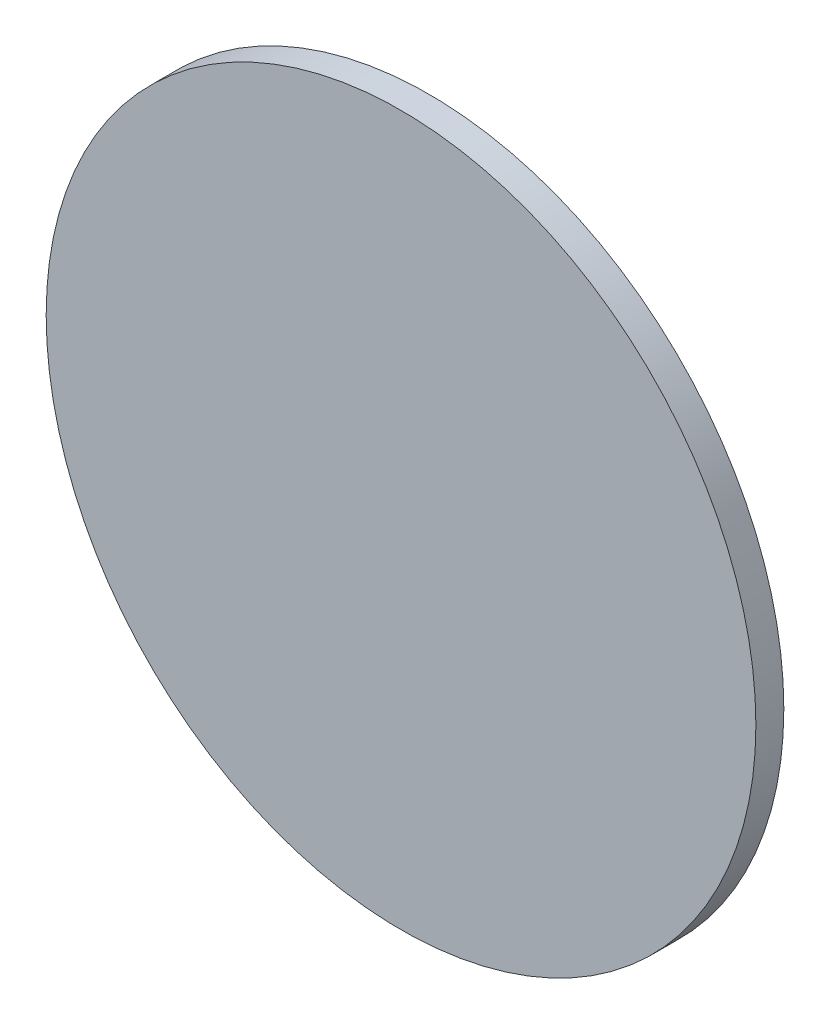
ISO-10303-21;
HEADER;
FILE_DESCRIPTION(('STEP AP214'),'2;1');
FILE_NAME('part.step','',(''),(''),'','','');
FILE_SCHEMA(('AUTOMOTIVE_DESIGN { 1 0 10303 214 1 1 1 1 }'));
ENDSEC;
DATA;
#1=APPLICATION_CONTEXT('core data for automotive mechanical design processes');
#2=APPLICATION_PROTOCOL_DEFINITION('international standard','automotive_design',2000,#1);
#3=PRODUCT_CONTEXT('',#1,'mechanical');
#4=PRODUCT('Part','Part','',(#3));
#5=PRODUCT_RELATED_PRODUCT_CATEGORY('part','',(#4));
#6=PRODUCT_DEFINITION_FORMATION('','',#4);
#7=PRODUCT_DEFINITION_CONTEXT('part definition',#1,'design');
#8=PRODUCT_DEFINITION('design','',#6,#7);
#9=PRODUCT_DEFINITION_SHAPE('','',#8);
#10=(LENGTH_UNIT() NAMED_UNIT(*) SI_UNIT(.MILLI.,.METRE.));
#11=(NAMED_UNIT(*) PLANE_ANGLE_UNIT() SI_UNIT($,.RADIAN.));
#12=(NAMED_UNIT(*) SI_UNIT($,.STERADIAN.) SOLID_ANGLE_UNIT());
#13=UNCERTAINTY_MEASURE_WITH_UNIT(LENGTH_MEASURE(1.E-05),#10,'distance_accuracy_value','');
#14=(GEOMETRIC_REPRESENTATION_CONTEXT(3) GLOBAL_UNCERTAINTY_ASSIGNED_CONTEXT((#13)) GLOBAL_UNIT_ASSIGNED_CONTEXT((#10,
#11,#12)) REPRESENTATION_CONTEXT('',''));
#15=CARTESIAN_POINT('',(0.,0.,0.));
#16=DIRECTION('',(0.,0.,1.));
#17=DIRECTION('',(1.,0.,0.));
#18=AXIS2_PLACEMENT_3D('',#15,#16,#17);
#19=CARTESIAN_POINT('',(0.,0.,3.));
#20=DIRECTION('',(0.,0.,-1.));
#21=DIRECTION('',(-1.,0.,0.));
#22=AXIS2_PLACEMENT_3D('',#19,#20,#21);
#23=CYLINDRICAL_SURFACE('',#22,38.1);
#24=CARTESIAN_POINT('',(0.,0.,3.));
#25=DIRECTION('',(0.,0.,1.));
#26=DIRECTION('',(1.,0.,0.));
#27=AXIS2_PLACEMENT_3D('',#24,#25,#26);
#28=CIRCLE('',#27,38.1);
#29=CARTESIAN_POINT('',(38.1,0.,3.));
#30=VERTEX_POINT('',#29);
#31=EDGE_CURVE('E61',#30,#30,#28,.T.);
#32=ORIENTED_EDGE('',*,*,#31,.F.);
#33=EDGE_LOOP('',(#32));
#34=FACE_BOUND('',#33,.T.);
#35=CARTESIAN_POINT('',(0.,0.,0.));
#36=DIRECTION('',(0.,0.,1.));
#37=DIRECTION('',(1.,0.,0.));
#38=AXIS2_PLACEMENT_3D('',#35,#36,#37);
#39=CIRCLE('',#38,38.1);
#40=CARTESIAN_POINT('',(38.1,0.,0.));
#41=VERTEX_POINT('',#40);
#42=EDGE_CURVE('E58',#41,#41,#39,.T.);
#43=ORIENTED_EDGE('',*,*,#42,.T.);
#44=EDGE_LOOP('',(#43));
#45=FACE_BOUND('',#44,.T.);
#46=ADVANCED_FACE('F35',(#34,#45),#23,.T.);
#47=CARTESIAN_POINT('',(0.,0.,3.));
#48=DIRECTION('',(0.,0.,1.));
#49=DIRECTION('',(1.,0.,0.));
#50=AXIS2_PLACEMENT_3D('',#47,#48,#49);
#51=PLANE('',#50);
#52=ORIENTED_EDGE('',*,*,#31,.T.);
#53=EDGE_LOOP('',(#52));
#54=FACE_BOUND('',#53,.T.);
#55=ADVANCED_FACE('F100',(#54),#51,.T.);
#56=CARTESIAN_POINT('',(0.,0.,0.));
#57=DIRECTION('',(0.,0.,1.));
#58=DIRECTION('',(1.,0.,0.));
#59=AXIS2_PLACEMENT_3D('',#56,#57,#58);
#60=PLANE('',#59);
#61=CARTESIAN_POINT('',(0.,0.,0.));
#62=DIRECTION('',(0.,0.,1.));
#63=DIRECTION('',(1.,0.,0.));
#64=AXIS2_PLACEMENT_3D('',#61,#62,#63);
#65=CIRCLE('',#64,1.75);
#66=CARTESIAN_POINT('',(1.75,0.,0.));
#67=VERTEX_POINT('',#66);
#68=EDGE_CURVE('E11',#67,#67,#65,.T.);
#69=ORIENTED_EDGE('',*,*,#68,.T.);
#70=EDGE_LOOP('',(#69));
#71=FACE_BOUND('',#70,.T.);
#72=ORIENTED_EDGE('',*,*,#42,.F.);
#73=EDGE_LOOP('',(#72));
#74=FACE_BOUND('',#73,.T.);
#75=ADVANCED_FACE('F98',(#71,#74),#60,.F.);
#76=CARTESIAN_POINT('',(2.,0.,-2.53589838486224));
#77=DIRECTION('',(-0.866025403784439,0.,0.5));
#78=DIRECTION('',(0.5,0.,0.866025403784439));
#79=AXIS2_PLACEMENT_3D('',#76,#77,#78);
#80=PLANE('',#79);
#81=CARTESIAN_POINT('',(2.,0.,-2.53589838486224));
#82=DIRECTION('',(-0.866025403784439,0.,0.5));
#83=DIRECTION('',(0.5,0.,0.866025403784439));
#84=AXIS2_PLACEMENT_3D('',#81,#82,#83);
#85=CIRCLE('',#84,0.75);
#86=CARTESIAN_POINT('',(2.375,0.,-1.88637933202392));
#87=VERTEX_POINT('',#86);
#88=EDGE_CURVE('E55',#87,#87,#85,.T.);
#89=ORIENTED_EDGE('',*,*,#88,.T.);
#90=EDGE_LOOP('',(#89));
#91=FACE_BOUND('',#90,.T.);
#92=ADVANCED_FACE('F89',(#91),#80,.T.);
#93=CARTESIAN_POINT('',(0.925,0.,-1.25));
#94=CARTESIAN_POINT('',(0.770833333333349,0.,-1.25));
#95=CARTESIAN_POINT('',(0.616666666666668,0.,-1.25));
#96=CARTESIAN_POINT('',(0.308333333333332,0.,-1.25));
#97=CARTESIAN_POINT('',(0.16861952633005,0.,-1.24998855800885));
#98=CARTESIAN_POINT('',(-0.263004260270211,0.,-1.25001784664257));
#99=CARTESIAN_POINT('',(-0.570565239422642,0.,-1.27578520813754));
#100=CARTESIAN_POINT('',(-1.13142949881977,0.,-1.37792066472334));
#101=CARTESIAN_POINT('',(-1.40723122850012,0.,-1.45429679643273));
#102=CARTESIAN_POINT('',(-2.20734245659167,0.,-1.75559089364515));
#103=CARTESIAN_POINT('',(-2.70337545902059,0.,-2.05296144874494));
#104=CARTESIAN_POINT('',(-3.98892694713479,0.,-3.18035984593469));
#105=CARTESIAN_POINT('',(-4.56057414059163,0.,-4.24983630097013));
#106=CARTESIAN_POINT('',(-4.85815204245957,0.,-6.51016487293938));
#107=CARTESIAN_POINT('',(-4.58278429455121,0.,-7.69115273551687));
#108=CARTESIAN_POINT('',(-3.31617702232297,0.,-9.58676447816934));
#109=CARTESIAN_POINT('',(-2.33046518287406,0.,-10.293115593208));
#110=CARTESIAN_POINT('',(-0.128315745599885,0.,-10.8831797565381));
#111=CARTESIAN_POINT('',(1.07851130569454,0.,-10.7643176666464));
#112=CARTESIAN_POINT('',(3.12323125138598,0.,-9.75597337791413));
#113=CARTESIAN_POINT('',(3.95220064774742,0.,-8.87089176131491));
#114=CARTESIAN_POINT('',(4.82465491110981,0.,-6.76460084615345));
#115=CARTESIAN_POINT('',(4.86433214709326,0.,-5.55258347062059));
#116=CARTESIAN_POINT('',(4.13150408311024,0.,-3.39374160899938));
#117=CARTESIAN_POINT('',(3.3641670674886,0.,-2.45747520661821));
#118=CARTESIAN_POINT('',(2.375,0.,-1.88637933202392));
#119=CARTESIAN_POINT('',(0.925,1.5,-1.25));
#120=CARTESIAN_POINT('',(0.770833333333349,1.5,-1.25));
#121=CARTESIAN_POINT('',(0.616666666666668,1.5,-1.25));
#122=CARTESIAN_POINT('',(0.308333333333332,1.5,-1.25));
#123=CARTESIAN_POINT('',(0.16861952633005,1.5,-1.24998855800885));
#124=CARTESIAN_POINT('',(-0.263004260270211,1.5,-1.25001784664257));
#125=CARTESIAN_POINT('',(-0.570565239422642,1.5,-1.27578520813754));
#126=CARTESIAN_POINT('',(-1.13142949881977,1.5,-1.37792066472334));
#127=CARTESIAN_POINT('',(-1.40723122850012,1.5,-1.45429679643273));
#128=CARTESIAN_POINT('',(-2.20734245659167,1.5,-1.75559089364515));
#129=CARTESIAN_POINT('',(-2.70337545902059,1.5,-2.05296144874494));
#130=CARTESIAN_POINT('',(-3.98892694713479,1.5,-3.18035984593469));
#131=CARTESIAN_POINT('',(-4.56057414059163,1.5,-4.24983630097013));
#132=CARTESIAN_POINT('',(-4.85815204245957,1.5,-6.51016487293938));
#133=CARTESIAN_POINT('',(-4.58278429455121,1.5,-7.69115273551687));
#134=CARTESIAN_POINT('',(-3.31617702232297,1.5,-9.58676447816934));
#135=CARTESIAN_POINT('',(-2.33046518287406,1.5,-10.293115593208));
#136=CARTESIAN_POINT('',(-0.128315745599885,1.5,-10.8831797565381));
#137=CARTESIAN_POINT('',(1.07851130569454,1.5,-10.7643176666464));
#138=CARTESIAN_POINT('',(3.12323125138598,1.5,-9.75597337791413));
#139=CARTESIAN_POINT('',(3.95220064774742,1.5,-8.87089176131491));
#140=CARTESIAN_POINT('',(4.82465491110981,1.5,-6.76460084615345));
#141=CARTESIAN_POINT('',(4.86433214709326,1.5,-5.55258347062059));
#142=CARTESIAN_POINT('',(4.13150408311024,1.5,-3.39374160899938));
#143=CARTESIAN_POINT('',(3.3641670674886,1.5,-2.45747520661821));
#144=CARTESIAN_POINT('',(2.375,1.5,-1.88637933202392));
#145=CARTESIAN_POINT('',(0.925,1.5,-2.75));
#146=CARTESIAN_POINT('',(0.770833333333349,1.5,-2.75));
#147=CARTESIAN_POINT('',(0.616666666666668,1.5,-2.75));
#148=CARTESIAN_POINT('',(0.308333333333332,1.5,-2.75));
#149=CARTESIAN_POINT('',(0.139713360120561,1.5,-2.74999217126923));
#150=CARTESIAN_POINT('',(-0.217917875397478,1.5,-2.75001221086069));
#151=CARTESIAN_POINT('',(-0.390386742762852,1.5,-2.76764251083098));
#152=CARTESIAN_POINT('',(-0.774135972876692,1.5,-2.83752466533699));
#153=CARTESIAN_POINT('',(-0.962842419500082,1.5,-2.88978201861186));
#154=CARTESIAN_POINT('',(-1.51028694398377,1.5,-3.09593061144144));
#155=CARTESIAN_POINT('',(-1.84967794564569,1.5,-3.29939467545722));
#156=CARTESIAN_POINT('',(-2.72926580593429,1.5,-4.07077252616553));
#157=CARTESIAN_POINT('',(-3.1203928330366,1.5,-4.80251957434807));
#158=CARTESIAN_POINT('',(-3.32399876589317,1.5,-6.34906017622159));
#159=CARTESIAN_POINT('',(-3.13558925416666,1.5,-7.15710450324895));
#160=CARTESIAN_POINT('',(-2.26896322579988,1.5,-8.45410201137847));
#161=CARTESIAN_POINT('',(-1.59452880933485,1.5,-8.93739487956329));
#162=CARTESIAN_POINT('',(-0.0877949838315344,1.5,-9.34112299131565));
#163=CARTESIAN_POINT('',(0.737928788106777,1.5,-9.25979629823245));
#164=CARTESIAN_POINT('',(2.13694769831674,1.5,-8.56987652173002));
#165=CARTESIAN_POINT('',(2.70413728530076,1.5,-7.96429436300465));
#166=CARTESIAN_POINT('',(3.3010796760226,1.5,-6.52314794736844));
#167=CARTESIAN_POINT('',(3.32822725853771,1.5,-5.69387290095019));
#168=CARTESIAN_POINT('',(2.82681858318047,1.5,-4.21677057457925));
#169=CARTESIAN_POINT('',(2.30179851986083,1.5,-3.57616724663438));
#170=CARTESIAN_POINT('',(1.625,1.5,-3.18541743770057));
#171=CARTESIAN_POINT('',(0.925,0.,-2.75));
#172=CARTESIAN_POINT('',(0.770833333333349,0.,-2.75));
#173=CARTESIAN_POINT('',(0.616666666666668,0.,-2.75));
#174=CARTESIAN_POINT('',(0.308333333333332,0.,-2.75));
#175=CARTESIAN_POINT('',(0.139713360120561,0.,-2.74999217126921));
#176=CARTESIAN_POINT('',(-0.217917875397478,0.,-2.75001221086072));
#177=CARTESIAN_POINT('',(-0.390386742762845,0.,-2.76764251083096));
#178=CARTESIAN_POINT('',(-0.774135972876698,0.,-2.83752466533701));
#179=CARTESIAN_POINT('',(-0.962842419500082,0.,-2.88978201861186));
#180=CARTESIAN_POINT('',(-1.51028694398377,0.,-3.09593061144144));
#181=CARTESIAN_POINT('',(-1.84967794564569,0.,-3.29939467545722));
#182=CARTESIAN_POINT('',(-2.72926580593429,0.,-4.07077252616553));
#183=CARTESIAN_POINT('',(-3.1203928330366,0.,-4.80251957434807));
#184=CARTESIAN_POINT('',(-3.32399876589317,0.,-6.34906017622159));
#185=CARTESIAN_POINT('',(-3.13558925416666,0.,-7.15710450324874));
#186=CARTESIAN_POINT('',(-2.26896322579988,0.,-8.45410201137867));
#187=CARTESIAN_POINT('',(-1.59452880933488,0.,-8.93739487956329));
#188=CARTESIAN_POINT('',(-0.0877949838315083,0.,-9.34112299131565));
#189=CARTESIAN_POINT('',(0.737928788106777,0.,-9.25979629823245));
#190=CARTESIAN_POINT('',(2.13694769831674,0.,-8.56987652173002));
#191=CARTESIAN_POINT('',(2.70413728530086,0.,-7.96429436300465));
#192=CARTESIAN_POINT('',(3.3010796760225,0.,-6.52314794736844));
#193=CARTESIAN_POINT('',(3.32822725853771,0.,-5.6938729009504));
#194=CARTESIAN_POINT('',(2.82681858318047,0.,-4.21677057457905));
#195=CARTESIAN_POINT('',(2.30179851986083,0.,-3.57616724663428));
#196=CARTESIAN_POINT('',(1.625,0.,-3.18541743770057));
#197=CARTESIAN_POINT('',(0.925,-1.5,-2.75));
#198=CARTESIAN_POINT('',(0.770833333333349,-1.5,-2.75));
#199=CARTESIAN_POINT('',(0.616666666666668,-1.5,-2.75));
#200=CARTESIAN_POINT('',(0.308333333333332,-1.5,-2.75));
#201=CARTESIAN_POINT('',(0.139713360120561,-1.5,-2.74999217126919));
#202=CARTESIAN_POINT('',(-0.217917875397478,-1.5,-2.75001221086074));
#203=CARTESIAN_POINT('',(-0.390386742762838,-1.5,-2.76764251083093));
#204=CARTESIAN_POINT('',(-0.774135972876705,-1.5,-2.83752466533704));
#205=CARTESIAN_POINT('',(-0.962842419500082,-1.5,-2.88978201861186));
#206=CARTESIAN_POINT('',(-1.51028694398377,-1.5,-3.09593061144144));
#207=CARTESIAN_POINT('',(-1.84967794564569,-1.5,-3.29939467545722));
#208=CARTESIAN_POINT('',(-2.72926580593429,-1.5,-4.07077252616553));
#209=CARTESIAN_POINT('',(-3.1203928330366,-1.5,-4.80251957434807));
#210=CARTESIAN_POINT('',(-3.32399876589317,-1.5,-6.34906017622159));
#211=CARTESIAN_POINT('',(-3.13558925416666,-1.5,-7.15710450324853));
#212=CARTESIAN_POINT('',(-2.26896322579988,-1.5,-8.45410201137888));
#213=CARTESIAN_POINT('',(-1.5945288093349,-1.5,-8.93739487956329));
#214=CARTESIAN_POINT('',(-0.0877949838314822,-1.5,-9.34112299131565));
#215=CARTESIAN_POINT('',(0.737928788106777,-1.5,-9.25979629823245));
#216=CARTESIAN_POINT('',(2.13694769831674,-1.5,-8.56987652173002));
#217=CARTESIAN_POINT('',(2.70413728530097,-1.5,-7.96429436300465));
#218=CARTESIAN_POINT('',(3.3010796760224,-1.5,-6.52314794736843));
#219=CARTESIAN_POINT('',(3.32822725853771,-1.5,-5.69387290095061));
#220=CARTESIAN_POINT('',(2.82681858318047,-1.5,-4.21677057457884));
#221=CARTESIAN_POINT('',(2.30179851986083,-1.5,-3.57616724663417));
#222=CARTESIAN_POINT('',(1.625,-1.5,-3.18541743770057));
#223=CARTESIAN_POINT('',(0.925,-1.5,-1.25));
#224=CARTESIAN_POINT('',(0.770833333333349,-1.5,-1.25));
#225=CARTESIAN_POINT('',(0.616666666666668,-1.5,-1.25));
#226=CARTESIAN_POINT('',(0.308333333333332,-1.5,-1.25));
#227=CARTESIAN_POINT('',(0.16861952633005,-1.5,-1.24998855800885));
#228=CARTESIAN_POINT('',(-0.263004260270211,-1.5,-1.25001784664257));
#229=CARTESIAN_POINT('',(-0.570565239422642,-1.5,-1.27578520813754));
#230=CARTESIAN_POINT('',(-1.13142949881977,-1.5,-1.37792066472334));
#231=CARTESIAN_POINT('',(-1.40723122850012,-1.5,-1.45429679643273));
#232=CARTESIAN_POINT('',(-2.20734245659167,-1.5,-1.75559089364515));
#233=CARTESIAN_POINT('',(-2.70337545902059,-1.5,-2.05296144874494));
#234=CARTESIAN_POINT('',(-3.98892694713479,-1.5,-3.18035984593469));
#235=CARTESIAN_POINT('',(-4.56057414059163,-1.5,-4.24983630097013));
#236=CARTESIAN_POINT('',(-4.85815204245957,-1.5,-6.51016487293938));
#237=CARTESIAN_POINT('',(-4.58278429455121,-1.5,-7.69115273551687));
#238=CARTESIAN_POINT('',(-3.31617702232297,-1.5,-9.58676447816934));
#239=CARTESIAN_POINT('',(-2.33046518287406,-1.5,-10.293115593208));
#240=CARTESIAN_POINT('',(-0.128315745599885,-1.5,-10.8831797565381));
#241=CARTESIAN_POINT('',(1.07851130569454,-1.5,-10.7643176666464));
#242=CARTESIAN_POINT('',(3.12323125138598,-1.5,-9.75597337791413));
#243=CARTESIAN_POINT('',(3.95220064774742,-1.5,-8.87089176131491));
#244=CARTESIAN_POINT('',(4.82465491110981,-1.5,-6.76460084615345));
#245=CARTESIAN_POINT('',(4.86433214709326,-1.5,-5.55258347062059));
#246=CARTESIAN_POINT('',(4.13150408311024,-1.5,-3.39374160899938));
#247=CARTESIAN_POINT('',(3.3641670674886,-1.5,-2.45747520661821));
#248=CARTESIAN_POINT('',(2.375,-1.5,-1.88637933202392));
#249=CARTESIAN_POINT('',(0.925,0.,-1.25));
#250=CARTESIAN_POINT('',(0.770833333333349,0.,-1.25));
#251=CARTESIAN_POINT('',(0.616666666666668,0.,-1.25));
#252=CARTESIAN_POINT('',(0.308333333333332,0.,-1.25));
#253=CARTESIAN_POINT('',(0.16861952633005,0.,-1.24998855800885));
#254=CARTESIAN_POINT('',(-0.263004260270211,0.,-1.25001784664257));
#255=CARTESIAN_POINT('',(-0.570565239422642,0.,-1.27578520813754));
#256=CARTESIAN_POINT('',(-1.13142949881977,0.,-1.37792066472334));
#257=CARTESIAN_POINT('',(-1.40723122850012,0.,-1.45429679643273));
#258=CARTESIAN_POINT('',(-2.20734245659167,0.,-1.75559089364515));
#259=CARTESIAN_POINT('',(-2.70337545902059,0.,-2.05296144874494));
#260=CARTESIAN_POINT('',(-3.98892694713479,0.,-3.18035984593469));
#261=CARTESIAN_POINT('',(-4.56057414059163,0.,-4.24983630097013));
#262=CARTESIAN_POINT('',(-4.85815204245957,0.,-6.51016487293938));
#263=CARTESIAN_POINT('',(-4.58278429455121,0.,-7.69115273551687));
#264=CARTESIAN_POINT('',(-3.31617702232297,0.,-9.58676447816934));
#265=CARTESIAN_POINT('',(-2.33046518287406,0.,-10.293115593208));
#266=CARTESIAN_POINT('',(-0.128315745599885,0.,-10.8831797565381));
#267=CARTESIAN_POINT('',(1.07851130569454,0.,-10.7643176666464));
#268=CARTESIAN_POINT('',(3.12323125138598,0.,-9.75597337791413));
#269=CARTESIAN_POINT('',(3.95220064774742,0.,-8.87089176131491));
#270=CARTESIAN_POINT('',(4.82465491110981,0.,-6.76460084615345));
#271=CARTESIAN_POINT('',(4.86433214709326,0.,-5.55258347062059));
#272=CARTESIAN_POINT('',(4.13150408311024,0.,-3.39374160899938));
#273=CARTESIAN_POINT('',(3.3641670674886,0.,-2.45747520661821));
#274=CARTESIAN_POINT('',(2.375,0.,-1.88637933202392));
#275=(BOUNDED_SURFACE() B_SPLINE_SURFACE(3,3,((#93,#94,#95,#96,#97,#98,#99,#100,#101,#102,#103,
#104,#105,#106,#107,#108,#109,#110,#111,#112,#113,#114,#115,#116,#117,#118),(#119,#120,#121,
#122,#123,#124,#125,#126,#127,#128,#129,#130,#131,#132,#133,#134,#135,#136,#137,#138,#139,#140,
#141,#142,#143,#144),(#145,#146,#147,#148,#149,#150,#151,#152,#153,#154,#155,#156,#157,#158,
#159,#160,#161,#162,#163,#164,#165,#166,#167,#168,#169,#170),(#171,#172,#173,#174,#175,#176,
#177,#178,#179,#180,#181,#182,#183,#184,#185,#186,#187,#188,#189,#190,#191,#192,#193,#194,#195,
#196),(#197,#198,#199,#200,#201,#202,#203,#204,#205,#206,#207,#208,#209,#210,#211,#212,#213,
#214,#215,#216,#217,#218,#219,#220,#221,#222),(#223,#224,#225,#226,#227,#228,#229,#230,#231,
#232,#233,#234,#235,#236,#237,#238,#239,#240,#241,#242,#243,#244,#245,#246,#247,#248),(#249,
#250,#251,#252,#253,#254,#255,#256,#257,#258,#259,#260,#261,#262,#263,#264,#265,#266,#267,#268,
#269,#270,#271,#272,#273,#274)),.UNSPECIFIED.,.T.,.F.,.F.) B_SPLINE_SURFACE_WITH_KNOTS((4,3,4),
(4,2,2,2,2,2,2,2,2,2,2,2,4),(0.,0.5,1.),(-0.040070531119156,-0.020035265559578,0.,0.03125,
0.0625,0.125,0.25,0.375,0.5,0.625,0.75,0.875,1.),
.UNSPECIFIED.) GEOMETRIC_REPRESENTATION_ITEM() RATIONAL_B_SPLINE_SURFACE(((1.,1.,1.,1.,1.,1.,1.,
1.,1.,1.,1.,1.,1.,1.,1.,1.,1.,1.,1.,1.,1.,1.,1.,1.,1.,1.),(0.333333333333333,0.333333333333333,
0.333333333333333,0.333333333333333,0.333333333333333,0.333333333333333,0.333333333333333,
0.333333333333333,0.333333333333333,0.333333333333333,0.333333333333333,0.333333333333333,
0.333333333333333,0.333333333333333,0.333333333333333,0.333333333333333,0.333333333333333,
0.333333333333333,0.333333333333333,0.333333333333333,0.333333333333333,0.333333333333333,
0.333333333333333,0.333333333333333,0.333333333333333,0.333333333333333),(0.333333333333333,
0.333333333333333,0.333333333333333,0.333333333333333,0.333333333333333,0.333333333333333,
0.333333333333333,0.333333333333333,0.333333333333333,0.333333333333333,0.333333333333333,
0.333333333333333,0.333333333333333,0.333333333333333,0.333333333333333,0.333333333333333,
0.333333333333333,0.333333333333333,0.333333333333333,0.333333333333333,0.333333333333333,
0.333333333333333,0.333333333333333,0.333333333333333,0.333333333333333,0.333333333333333),(1.,
1.,1.,1.,1.,1.,1.,1.,1.,1.,1.,1.,1.,1.,1.,1.,1.,1.,1.,1.,1.,1.,1.,1.,1.,1.),(0.333333333333333,
0.333333333333333,0.333333333333333,0.333333333333333,0.333333333333333,0.333333333333333,
0.333333333333333,0.333333333333333,0.333333333333333,0.333333333333333,0.333333333333333,
0.333333333333333,0.333333333333333,0.333333333333333,0.333333333333333,0.333333333333333,
0.333333333333333,0.333333333333333,0.333333333333333,0.333333333333333,0.333333333333333,
0.333333333333333,0.333333333333333,0.333333333333333,0.333333333333333,0.333333333333333),
(0.333333333333333,0.333333333333333,0.333333333333333,0.333333333333333,0.333333333333333,
0.333333333333333,0.333333333333333,0.333333333333333,0.333333333333333,0.333333333333333,
0.333333333333333,0.333333333333333,0.333333333333333,0.333333333333333,0.333333333333333,
0.333333333333333,0.333333333333333,0.333333333333333,0.333333333333333,0.333333333333333,
0.333333333333333,0.333333333333333,0.333333333333333,0.333333333333333,0.333333333333333,
0.333333333333333),(1.,1.,1.,1.,1.,1.,1.,1.,1.,1.,1.,1.,1.,1.,1.,1.,1.,1.,1.,1.,1.,1.,1.,1.,1.,1.))) REPRESENTATION_ITEM('') SURFACE());
#276=CARTESIAN_POINT('',(0.,-0.75,-2.));
#277=CARTESIAN_POINT('',(-0.00129097048309606,-0.749999992212537,-1.99870909336577));
#278=CARTESIAN_POINT('',(-0.00258232190258814,-0.749996659323704,-1.99741844848039));
#279=CARTESIAN_POINT('',(-0.0583985864539804,-0.749708665442318,-1.94166042760945));
#280=CARTESIAN_POINT('',(-0.113580839621577,-0.743490593518385,-1.88767781848776));
#281=CARTESIAN_POINT('',(-0.223570552438034,-0.718128013005765,-1.78217739602593));
#282=CARTESIAN_POINT('',(-0.278377303193083,-0.698963592514793,-1.73066351056053));
#283=CARTESIAN_POINT('',(-0.368940327892154,-0.654294283311102,-1.64691688442384));
#284=CARTESIAN_POINT('',(-0.405446853407421,-0.632457689222105,-1.61356321392407));
#285=CARTESIAN_POINT('',(-0.458179808053952,-0.594173218333215,-1.56585464307678));
#286=CARTESIAN_POINT('',(-0.47540510552329,-0.580504866289818,-1.55035164660365));
#287=CARTESIAN_POINT('',(-0.509036668227036,-0.551252349478753,-1.52022187938262));
#288=CARTESIAN_POINT('',(-0.525441788257891,-0.535665605658801,-1.50559632840308));
#289=CARTESIAN_POINT('',(-0.566276891685542,-0.493082123031972,-1.46934532143371));
#290=CARTESIAN_POINT('',(-0.589936893993683,-0.464654245536149,-1.44849456205187));
#291=CARTESIAN_POINT('',(-0.633583705811753,-0.403099959233,-1.41024150233743));
#292=CARTESIAN_POINT('',(-0.653577870280339,-0.369983200045255,-1.39283229143324));
#293=CARTESIAN_POINT('',(-0.685792598375596,-0.305391005796364,-1.36490066510931));
#294=CARTESIAN_POINT('',(-0.698754944689221,-0.274575714698166,-1.35371249483914));
#295=CARTESIAN_POINT('',(-0.720634085033173,-0.210537464830522,-1.33487511647873));
#296=CARTESIAN_POINT('',(-0.729557494566363,-0.17731854733214,-1.32722012088067));
#297=CARTESIAN_POINT('',(-0.740731334936482,-0.119944912824481,-1.31764675890497));
#298=CARTESIAN_POINT('',(-0.744194726782882,-0.0961919565655386,-1.31468405180911));
#299=CARTESIAN_POINT('',(-0.748830085215616,-0.0482964886457701,-1.31072023671607));
#300=CARTESIAN_POINT('',(-0.750001692766102,-0.0241539165441211,-1.3097194360753));
#301=CARTESIAN_POINT('',(-0.749997564975478,0.0347451304922567,-1.30972268107001));
#302=CARTESIAN_POINT('',(-0.747567279346922,0.0695137354616944,-1.31179825476553));
#303=CARTESIAN_POINT('',(-0.738019536065206,0.137927390785776,-1.31996868947101));
#304=CARTESIAN_POINT('',(-0.730897062839856,0.17157119834218,-1.32606785138368));
#305=CARTESIAN_POINT('',(-0.712505783253444,0.236581047643503,-1.34186746808718));
#306=CARTESIAN_POINT('',(-0.70126043143912,0.267958795078871,-1.35154755419112));
#307=CARTESIAN_POINT('',(-0.675252315191512,0.328038407931077,-1.37402758043446));
#308=CARTESIAN_POINT('',(-0.660485013223763,0.356736754397238,-1.38683154574336));
#309=CARTESIAN_POINT('',(-0.622850547802405,0.419893386813243,-1.41962195897793));
#310=CARTESIAN_POINT('',(-0.598909626221058,0.453201901527551,-1.44059113030712));
#311=CARTESIAN_POINT('',(-0.547447282171432,0.514199700875781,-1.48601031585516));
#312=CARTESIAN_POINT('',(-0.519919622803534,0.541878977101617,-1.51046640054161));
#313=CARTESIAN_POINT('',(-0.453201630233809,0.599691206276567,-1.57025096027581));
#314=CARTESIAN_POINT('',(-0.413100675457002,0.627768318533066,-1.60655220856835));
#315=CARTESIAN_POINT('',(-0.330628631390116,0.674870057443114,-1.68218170780597));
#316=CARTESIAN_POINT('',(-0.288254860566276,0.693883717251834,-1.72151355932586));
#317=CARTESIAN_POINT('',(-0.165490400152516,0.736374080985277,-1.83721055697015));
#318=CARTESIAN_POINT('',(-0.083805891030678,0.749577065910812,-1.91628084676361));
#319=CARTESIAN_POINT('',(-0.00258223216887432,0.749996667965158,-1.99741851854134));
#320=CARTESIAN_POINT('',(-0.00129087965787039,0.75000000082297,-1.99870916419086));
#321=CARTESIAN_POINT('',(0.,0.75,-2.));
#322=B_SPLINE_CURVE_WITH_KNOTS('',3,(#276,#277,#278,#279,#280,#281,#282,#283,#284,#285,#286,
#287,#288,#289,#290,#291,#292,#293,#294,#295,#296,#297,#298,#299,#300,#301,#302,#303,#304,#305,
#306,#307,#308,#309,#310,#311,#312,#313,#314,#315,#316,#317,#318,#319,#320,#321),.UNSPECIFIED.,
.F.,.F.,(4,2,2,2,2,2,2,2,2,2,2,2,2,2,2,2,2,2,2,2,2,2,4),(0.,0.00547723487978084,
0.236675641375125,0.468230450525952,0.629783335300698,0.710415221785575,0.791156717331903,
0.918027500751443,1.04464088268298,1.14996721975777,1.25512040957766,1.32750073383201,
1.39989239643549,1.50402696852921,1.60827303313164,1.71193503066404,1.81573131041901,
1.95318468941346,2.09088035503415,2.27269867143766,2.45473643438726,2.79364495098259,
2.79912218586237),.UNSPECIFIED.);
#323=CARTESIAN_POINT('',(0.,-0.75,-2.));
#324=VERTEX_POINT('',#323);
#325=CARTESIAN_POINT('',(0.,0.75,-2.));
#326=VERTEX_POINT('',#325);
#327=EDGE_CURVE('E50',#324,#326,#322,.T.);
#328=CARTESIAN_POINT('',(0.,0.75,-2.));
#329=CARTESIAN_POINT('',(0.00129098579365868,0.749999989623951,-2.00129090492108));
#330=CARTESIAN_POINT('',(0.00258202332328393,0.749996656802515,-2.00258186300753));
#331=CARTESIAN_POINT('',(0.0614170249587257,0.749693272688364,-2.06141330862081));
#332=CARTESIAN_POINT('',(0.119043725566068,0.742792039629431,-2.11903933139817));
#333=CARTESIAN_POINT('',(0.232795905162573,0.715360526948671,-2.2327922437107));
#334=CARTESIAN_POINT('',(0.288918087672203,0.694802518478563,-2.28891584102243));
#335=CARTESIAN_POINT('',(0.380961935416688,0.647436034977487,-2.38096131546148));
#336=CARTESIAN_POINT('',(0.417855550309264,0.624403825394602,-2.41785537674344));
#337=CARTESIAN_POINT('',(0.488706962390722,0.570646144160921,-2.48870711585776));
#338=CARTESIAN_POINT('',(0.522671192609308,0.53993813896516,-2.52267122799339));
#339=CARTESIAN_POINT('',(0.57792373964137,0.479296221006471,-2.57792371338749));
#340=CARTESIAN_POINT('',(0.600221495149527,0.451207112176718,-2.60022148816895));
#341=CARTESIAN_POINT('',(0.64144570150606,0.390376262068928,-2.64144570848454));
#342=CARTESIAN_POINT('',(0.660373445061333,0.357636313513929,-2.66037344673502));
#343=CARTESIAN_POINT('',(0.690311978879661,0.2948280201715,-2.69031197754337));
#344=CARTESIAN_POINT('',(0.702149555275412,0.265551726538331,-2.70214955491746));
#345=CARTESIAN_POINT('',(0.722238034092389,0.204682271046772,-2.72223803444954));
#346=CARTESIAN_POINT('',(0.730497731447519,0.173095016094319,-2.73049773154451));
#347=CARTESIAN_POINT('',(0.742916193785193,0.108065876354783,-2.74291619368742));
#348=CARTESIAN_POINT('',(0.747043643869689,0.0746118281509471,-2.74704364383977));
#349=CARTESIAN_POINT('',(0.750723390096157,0.00720451096883228,-2.75072339012606));
#350=CARTESIAN_POINT('',(0.750277543353861,-0.0267485497787297,-2.75027754337577));
#351=CARTESIAN_POINT('',(0.745151542097714,-0.0903163183340628,-2.74515154207814));
#352=CARTESIAN_POINT('',(0.740927830022829,-0.120007667709872,-2.74092782997258));
#353=CARTESIAN_POINT('',(0.729164214166469,-0.178034916126944,-2.72916421421674));
#354=CARTESIAN_POINT('',(0.721623771769964,-0.206370594187153,-2.72162377195146));
#355=CARTESIAN_POINT('',(0.703258887689069,-0.262362959796335,-2.70325888749942));
#356=CARTESIAN_POINT('',(0.692302168280722,-0.289932001326033,-2.69230216755996));
#357=CARTESIAN_POINT('',(0.667772267508134,-0.342679679726303,-2.6677722682303));
#358=CARTESIAN_POINT('',(0.654193547552943,-0.367853085086332,-2.65419355025449));
#359=CARTESIAN_POINT('',(0.616933132565528,-0.428683755839505,-2.61693312838745));
#360=CARTESIAN_POINT('',(0.591785839852694,-0.462551288537958,-2.59178582030064));
#361=CARTESIAN_POINT('',(0.538015043035024,-0.52413507520899,-2.5380150626103));
#362=CARTESIAN_POINT('',(0.509387034863503,-0.551843224989743,-2.50938710903152));
#363=CARTESIAN_POINT('',(0.436886974421019,-0.612134269907713,-2.43688686835608));
#364=CARTESIAN_POINT('',(0.391753893592064,-0.641688872627305,-2.39175341813608));
#365=CARTESIAN_POINT('',(0.298770214596614,-0.689917851077158,-2.2987681902591));
#366=CARTESIAN_POINT('',(0.250918040735368,-0.708585846055354,-2.25091483643315));
#367=CARTESIAN_POINT('',(0.137010324199601,-0.740485620867246,-2.13700576532392));
#368=CARTESIAN_POINT('',(0.0703483171348842,-0.749647124253876,-2.07034406824253));
#369=CARTESIAN_POINT('',(0.00258199396313489,-0.749996658776371,-2.00258183395001));
#370=CARTESIAN_POINT('',(0.00129095608403469,-0.749999991585211,-2.00129087536983));
#371=CARTESIAN_POINT('',(0.,-0.75,-2.));
#372=B_SPLINE_CURVE_WITH_KNOTS('',3,(#328,#329,#330,#331,#332,#333,#334,#335,#336,#337,#338,
#339,#340,#341,#342,#343,#344,#345,#346,#347,#348,#349,#350,#351,#352,#353,#354,#355,#356,#357,
#358,#359,#360,#361,#362,#363,#364,#365,#366,#367,#368,#369,#370,#371),.UNSPECIFIED.,.F.,.F.,(4,
2,2,2,2,2,2,2,2,2,2,2,2,2,2,2,2,2,2,2,2,4),(0.,0.00547723471034894,0.249599802440021,
0.49421956018097,0.664785399304272,0.834966589935031,0.96123570261165,1.0874562747242,
1.18823064583295,1.28875587377023,1.39003726072945,1.49127752116321,1.58172559732768,
1.67218836708636,1.76671387866769,1.8614412900542,2.00794177193626,2.15463388528835,
2.36441286289661,2.57431467085395,2.85632071324,2.86179794794991),.UNSPECIFIED.);
#373=EDGE_CURVE('E52',#324,#326,#372,.F.);
#374=ORIENTED_EDGE('',*,*,#88,.F.);
#375=EDGE_LOOP('',(#374));
#376=FACE_BOUND('',#375,.T.);
#377=ORIENTED_EDGE('',*,*,#327,.T.);
#378=ORIENTED_EDGE('',*,*,#373,.F.);
#379=EDGE_LOOP('',(#377,#378));
#380=FACE_BOUND('',#379,.T.);
#381=ADVANCED_FACE('F53',(#376,#380),#275,.T.);
#382=CARTESIAN_POINT('',(0.,0.,0.));
#383=DIRECTION('',(0.,0.,-1.));
#384=DIRECTION('',(-1.,0.,0.));
#385=AXIS2_PLACEMENT_3D('',#382,#383,#384);
#386=CYLINDRICAL_SURFACE('',#385,0.75);
#387=CARTESIAN_POINT('',(0.,0.,-1.00000000000001));
#388=DIRECTION('',(0.,0.,1.));
#389=DIRECTION('',(1.,0.,0.));
#390=AXIS2_PLACEMENT_3D('',#387,#388,#389);
#391=CIRCLE('',#390,0.75);
#392=CARTESIAN_POINT('',(0.75,0.,-1.00000000000001));
#393=VERTEX_POINT('',#392);
#394=EDGE_CURVE('E44',#393,#393,#391,.F.);
#395=ORIENTED_EDGE('',*,*,#394,.T.);
#396=EDGE_LOOP('',(#395));
#397=FACE_BOUND('',#396,.T.);
#398=ORIENTED_EDGE('',*,*,#373,.T.);
#399=ORIENTED_EDGE('',*,*,#327,.F.);
#400=EDGE_LOOP('',(#398,#399));
#401=FACE_BOUND('',#400,.T.);
#402=ADVANCED_FACE('F57',(#397,#401),#386,.T.);
#403=CARTESIAN_POINT('',(0.,0.,-1.00000000000001));
#404=DIRECTION('',(0.,0.,1.));
#405=DIRECTION('',(1.,0.,0.));
#406=AXIS2_PLACEMENT_3D('',#403,#404,#405);
#407=CONICAL_SURFACE('',#406,0.75,0.785398163397445);
#408=ORIENTED_EDGE('',*,*,#68,.F.);
#409=EDGE_LOOP('',(#408));
#410=FACE_BOUND('',#409,.T.);
#411=ORIENTED_EDGE('',*,*,#394,.F.);
#412=EDGE_LOOP('',(#411));
#413=FACE_BOUND('',#412,.T.);
#414=ADVANCED_FACE('F38',(#410,#413),#407,.T.);
#415=CLOSED_SHELL('',(#46,#55,#75,#92,#381,#402,#414));
#416=MANIFOLD_SOLID_BREP('B2',#415);
#417=ADVANCED_BREP_SHAPE_REPRESENTATION('',(#18,#416),#14);
#418=SHAPE_DEFINITION_REPRESENTATION(#9,#417);
ENDSEC;
END-ISO-10303-21;
